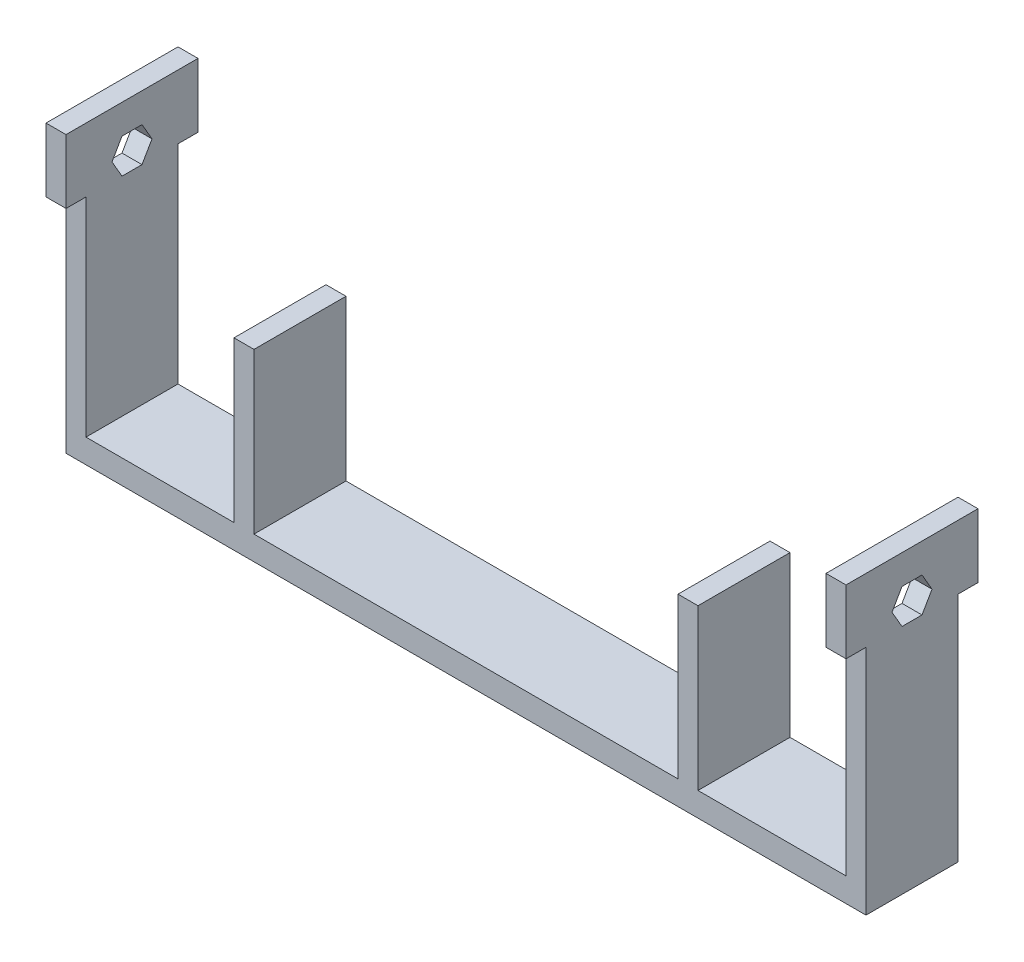
ISO-10303-21;
HEADER;
FILE_DESCRIPTION(('STEP AP214'),'2;1');
FILE_NAME('part.step','',(''),(''),'','','');
FILE_SCHEMA(('AUTOMOTIVE_DESIGN { 1 0 10303 214 1 1 1 1 }'));
ENDSEC;
DATA;
#1=APPLICATION_CONTEXT('core data for automotive mechanical design processes');
#2=APPLICATION_PROTOCOL_DEFINITION('international standard','automotive_design',2000,#1);
#3=PRODUCT_CONTEXT('',#1,'mechanical');
#4=PRODUCT('Part','Part','',(#3));
#5=PRODUCT_RELATED_PRODUCT_CATEGORY('part','',(#4));
#6=PRODUCT_DEFINITION_FORMATION('','',#4);
#7=PRODUCT_DEFINITION_CONTEXT('part definition',#1,'design');
#8=PRODUCT_DEFINITION('design','',#6,#7);
#9=PRODUCT_DEFINITION_SHAPE('','',#8);
#10=(LENGTH_UNIT() NAMED_UNIT(*) SI_UNIT(.MILLI.,.METRE.));
#11=(NAMED_UNIT(*) PLANE_ANGLE_UNIT() SI_UNIT($,.RADIAN.));
#12=(NAMED_UNIT(*) SI_UNIT($,.STERADIAN.) SOLID_ANGLE_UNIT());
#13=UNCERTAINTY_MEASURE_WITH_UNIT(LENGTH_MEASURE(1.E-05),#10,'distance_accuracy_value','');
#14=(GEOMETRIC_REPRESENTATION_CONTEXT(3) GLOBAL_UNCERTAINTY_ASSIGNED_CONTEXT((#13)) GLOBAL_UNIT_ASSIGNED_CONTEXT((#10,
#11,#12)) REPRESENTATION_CONTEXT('',''));
#15=CARTESIAN_POINT('',(0.,0.,0.));
#16=DIRECTION('',(0.,0.,1.));
#17=DIRECTION('',(1.,0.,0.));
#18=AXIS2_PLACEMENT_3D('',#15,#16,#17);
#19=CARTESIAN_POINT('',(0.,3.,0.));
#20=DIRECTION('',(0.,-1.,0.));
#21=DIRECTION('',(0.,0.,-1.));
#22=AXIS2_PLACEMENT_3D('',#19,#20,#21);
#23=PLANE('',#22);
#24=DIRECTION('',(0.,0.,-1.));
#25=VECTOR('',#24,1.);
#26=CARTESIAN_POINT('',(23.5,3.,-11.5));
#27=LINE('',#26,#25);
#28=CARTESIAN_POINT('',(23.5,3.,0.));
#29=VERTEX_POINT('',#28);
#30=CARTESIAN_POINT('',(23.5,3.,-11.5));
#31=VERTEX_POINT('',#30);
#32=EDGE_CURVE('E494',#29,#31,#27,.T.);
#33=ORIENTED_EDGE('',*,*,#32,.F.);
#34=DIRECTION('',(1.,0.,0.));
#35=VECTOR('',#34,1.);
#36=CARTESIAN_POINT('',(0.,3.,0.));
#37=LINE('',#36,#35);
#38=CARTESIAN_POINT('',(76.5,3.,0.));
#39=VERTEX_POINT('',#38);
#40=EDGE_CURVE('E592',#29,#39,#37,.T.);
#41=ORIENTED_EDGE('',*,*,#40,.T.);
#42=DIRECTION('',(0.,0.,1.));
#43=VECTOR('',#42,1.);
#44=CARTESIAN_POINT('',(76.5,3.,-11.5));
#45=LINE('',#44,#43);
#46=CARTESIAN_POINT('',(76.5,3.,-11.5));
#47=VERTEX_POINT('',#46);
#48=EDGE_CURVE('E499',#47,#39,#45,.T.);
#49=ORIENTED_EDGE('',*,*,#48,.F.);
#50=DIRECTION('',(-1.,0.,0.));
#51=VECTOR('',#50,1.);
#52=CARTESIAN_POINT('',(0.,3.,-11.5));
#53=LINE('',#52,#51);
#54=EDGE_CURVE('E598',#47,#31,#53,.T.);
#55=ORIENTED_EDGE('',*,*,#54,.T.);
#56=EDGE_LOOP('',(#33,#41,#49,#55));
#57=FACE_BOUND('',#56,.T.);
#58=ADVANCED_FACE('F43',(#57),#23,.F.);
#59=DIRECTION('',(0.,0.,1.));
#60=VECTOR('',#59,1.);
#61=CARTESIAN_POINT('',(21.,3.,-11.5));
#62=LINE('',#61,#60);
#63=CARTESIAN_POINT('',(21.,3.,-11.5));
#64=VERTEX_POINT('',#63);
#65=CARTESIAN_POINT('',(21.,3.,0.));
#66=VERTEX_POINT('',#65);
#67=EDGE_CURVE('E490',#64,#66,#62,.T.);
#68=ORIENTED_EDGE('',*,*,#67,.F.);
#69=CARTESIAN_POINT('',(2.5,3.,-11.5));
#70=VERTEX_POINT('',#69);
#71=EDGE_CURVE('E591',#64,#70,#53,.T.);
#72=ORIENTED_EDGE('',*,*,#71,.T.);
#73=DIRECTION('',(0.,0.,-1.));
#74=VECTOR('',#73,1.);
#75=CARTESIAN_POINT('',(2.5,3.,-11.5));
#76=LINE('',#75,#74);
#77=CARTESIAN_POINT('',(2.5,3.,0.));
#78=VERTEX_POINT('',#77);
#79=EDGE_CURVE('E560',#78,#70,#76,.T.);
#80=ORIENTED_EDGE('',*,*,#79,.F.);
#81=EDGE_CURVE('E588',#78,#66,#37,.T.);
#82=ORIENTED_EDGE('',*,*,#81,.T.);
#83=EDGE_LOOP('',(#68,#72,#80,#82));
#84=FACE_BOUND('',#83,.T.);
#85=ADVANCED_FACE('F689',(#84),#23,.F.);
#86=DIRECTION('',(0.,0.,-1.));
#87=VECTOR('',#86,1.);
#88=CARTESIAN_POINT('',(79.,3.,-11.5));
#89=LINE('',#88,#87);
#90=CARTESIAN_POINT('',(79.,3.,0.));
#91=VERTEX_POINT('',#90);
#92=CARTESIAN_POINT('',(79.,3.,-11.5));
#93=VERTEX_POINT('',#92);
#94=EDGE_CURVE('E516',#91,#93,#89,.T.);
#95=ORIENTED_EDGE('',*,*,#94,.F.);
#96=CARTESIAN_POINT('',(97.5,3.,0.));
#97=VERTEX_POINT('',#96);
#98=EDGE_CURVE('E593',#91,#97,#37,.T.);
#99=ORIENTED_EDGE('',*,*,#98,.T.);
#100=DIRECTION('',(0.,0.,1.));
#101=VECTOR('',#100,1.);
#102=CARTESIAN_POINT('',(97.5,3.,-11.5));
#103=LINE('',#102,#101);
#104=CARTESIAN_POINT('',(97.5,3.,-11.5));
#105=VERTEX_POINT('',#104);
#106=EDGE_CURVE('E556',#105,#97,#103,.T.);
#107=ORIENTED_EDGE('',*,*,#106,.F.);
#108=EDGE_CURVE('E594',#105,#93,#53,.T.);
#109=ORIENTED_EDGE('',*,*,#108,.T.);
#110=EDGE_LOOP('',(#95,#99,#107,#109));
#111=FACE_BOUND('',#110,.T.);
#112=ADVANCED_FACE('F692',(#111),#23,.F.);
#113=CARTESIAN_POINT('',(0.,3.,0.));
#114=DIRECTION('',(1.,0.,0.));
#115=DIRECTION('',(0.,0.,-1.));
#116=AXIS2_PLACEMENT_3D('',#113,#114,#115);
#117=PLANE('',#116);
#118=DIRECTION('',(0.,0.,-1.));
#119=VECTOR('',#118,1.);
#120=CARTESIAN_POINT('',(0.,29.,-4.5));
#121=LINE('',#120,#119);
#122=CARTESIAN_POINT('',(0.,29.,-4.5));
#123=VERTEX_POINT('',#122);
#124=CARTESIAN_POINT('',(0.,29.,-7.));
#125=VERTEX_POINT('',#124);
#126=EDGE_CURVE('E304',#123,#125,#121,.T.);
#127=ORIENTED_EDGE('',*,*,#126,.T.);
#128=DIRECTION('',(0.,0.866025403784439,-0.499999999999999));
#129=VECTOR('',#128,1.);
#130=CARTESIAN_POINT('',(0.,29.,-7.));
#131=LINE('',#130,#129);
#132=CARTESIAN_POINT('',(0.,31.1650635094611,-8.25));
#133=VERTEX_POINT('',#132);
#134=EDGE_CURVE('E284',#125,#133,#131,.T.);
#135=ORIENTED_EDGE('',*,*,#134,.T.);
#136=DIRECTION('',(0.,0.866025403784438,0.500000000000001));
#137=VECTOR('',#136,1.);
#138=CARTESIAN_POINT('',(0.,31.1650635094611,-8.25));
#139=LINE('',#138,#137);
#140=CARTESIAN_POINT('',(0.,33.3301270189222,-7.));
#141=VERTEX_POINT('',#140);
#142=EDGE_CURVE('E295',#133,#141,#139,.T.);
#143=ORIENTED_EDGE('',*,*,#142,.T.);
#144=DIRECTION('',(0.,0.,1.));
#145=VECTOR('',#144,1.);
#146=CARTESIAN_POINT('',(0.,33.3301270189222,-7.));
#147=LINE('',#146,#145);
#148=CARTESIAN_POINT('',(0.,33.3301270189222,-4.5));
#149=VERTEX_POINT('',#148);
#150=EDGE_CURVE('E59',#141,#149,#147,.T.);
#151=ORIENTED_EDGE('',*,*,#150,.T.);
#152=DIRECTION('',(0.,-0.866025403784439,0.499999999999999));
#153=VECTOR('',#152,1.);
#154=CARTESIAN_POINT('',(0.,33.3301270189222,-4.5));
#155=LINE('',#154,#153);
#156=CARTESIAN_POINT('',(0.,31.1650635094611,-3.25));
#157=VERTEX_POINT('',#156);
#158=EDGE_CURVE('E315',#149,#157,#155,.T.);
#159=ORIENTED_EDGE('',*,*,#158,.T.);
#160=DIRECTION('',(0.,-0.866025403784439,-0.5));
#161=VECTOR('',#160,1.);
#162=CARTESIAN_POINT('',(0.,31.1650635094611,-3.25));
#163=LINE('',#162,#161);
#164=EDGE_CURVE('E319',#157,#123,#163,.T.);
#165=ORIENTED_EDGE('',*,*,#164,.T.);
#166=EDGE_LOOP('',(#127,#135,#143,#151,#159,#165));
#167=FACE_BOUND('',#166,.T.);
#168=DIRECTION('',(0.,0.,1.));
#169=VECTOR('',#168,1.);
#170=CARTESIAN_POINT('',(0.,0.,0.));
#171=LINE('',#170,#169);
#172=CARTESIAN_POINT('',(0.,0.,-11.5));
#173=VERTEX_POINT('',#172);
#174=CARTESIAN_POINT('',(0.,0.,0.));
#175=VERTEX_POINT('',#174);
#176=EDGE_CURVE('E587',#173,#175,#171,.T.);
#177=ORIENTED_EDGE('',*,*,#176,.T.);
#178=DIRECTION('',(0.,-1.,0.));
#179=VECTOR('',#178,1.);
#180=CARTESIAN_POINT('',(0.,3.,0.));
#181=LINE('',#180,#179);
#182=CARTESIAN_POINT('',(0.,29.,0.));
#183=VERTEX_POINT('',#182);
#184=EDGE_CURVE('E622',#183,#175,#181,.T.);
#185=ORIENTED_EDGE('',*,*,#184,.F.);
#186=DIRECTION('',(0.,0.,1.));
#187=VECTOR('',#186,1.);
#188=CARTESIAN_POINT('',(0.,29.,-14.));
#189=LINE('',#188,#187);
#190=CARTESIAN_POINT('',(0.,29.,2.5));
#191=VERTEX_POINT('',#190);
#192=EDGE_CURVE('E417',#183,#191,#189,.T.);
#193=ORIENTED_EDGE('',*,*,#192,.T.);
#194=DIRECTION('',(0.,-1.,0.));
#195=VECTOR('',#194,1.);
#196=CARTESIAN_POINT('',(0.,37.,2.5));
#197=LINE('',#196,#195);
#198=CARTESIAN_POINT('',(0.,37.,2.5));
#199=VERTEX_POINT('',#198);
#200=EDGE_CURVE('E469',#199,#191,#197,.T.);
#201=ORIENTED_EDGE('',*,*,#200,.F.);
#202=DIRECTION('',(0.,0.,1.));
#203=VECTOR('',#202,1.);
#204=CARTESIAN_POINT('',(0.,37.,-14.));
#205=LINE('',#204,#203);
#206=CARTESIAN_POINT('',(0.,37.,-14.));
#207=VERTEX_POINT('',#206);
#208=EDGE_CURVE('E429',#207,#199,#205,.T.);
#209=ORIENTED_EDGE('',*,*,#208,.F.);
#210=DIRECTION('',(0.,-1.,0.));
#211=VECTOR('',#210,1.);
#212=CARTESIAN_POINT('',(0.,37.,-14.));
#213=LINE('',#212,#211);
#214=CARTESIAN_POINT('',(0.,29.,-14.));
#215=VERTEX_POINT('',#214);
#216=EDGE_CURVE('E443',#207,#215,#213,.T.);
#217=ORIENTED_EDGE('',*,*,#216,.T.);
#218=CARTESIAN_POINT('',(0.,29.,-11.5));
#219=VERTEX_POINT('',#218);
#220=EDGE_CURVE('E444',#215,#219,#189,.T.);
#221=ORIENTED_EDGE('',*,*,#220,.T.);
#222=DIRECTION('',(0.,-1.,0.));
#223=VECTOR('',#222,1.);
#224=CARTESIAN_POINT('',(0.,3.,-11.5));
#225=LINE('',#224,#223);
#226=EDGE_CURVE('E597',#219,#173,#225,.T.);
#227=ORIENTED_EDGE('',*,*,#226,.T.);
#228=EDGE_LOOP('',(#177,#185,#193,#201,#209,#217,#221,#227));
#229=FACE_BOUND('',#228,.T.);
#230=ADVANCED_FACE('F45',(#167,#229),#117,.F.);
#231=CARTESIAN_POINT('',(0.,3.,0.));
#232=DIRECTION('',(0.,0.,-1.));
#233=DIRECTION('',(-1.,0.,0.));
#234=AXIS2_PLACEMENT_3D('',#231,#232,#233);
#235=PLANE('',#234);
#236=DIRECTION('',(1.,0.,0.));
#237=VECTOR('',#236,1.);
#238=CARTESIAN_POINT('',(0.,0.,0.));
#239=LINE('',#238,#237);
#240=CARTESIAN_POINT('',(100.,0.,0.));
#241=VERTEX_POINT('',#240);
#242=EDGE_CURVE('E602',#175,#241,#239,.T.);
#243=ORIENTED_EDGE('',*,*,#242,.T.);
#244=DIRECTION('',(0.,-1.,0.));
#245=VECTOR('',#244,1.);
#246=CARTESIAN_POINT('',(100.,3.,0.));
#247=LINE('',#246,#245);
#248=CARTESIAN_POINT('',(100.,29.,0.));
#249=VERTEX_POINT('',#248);
#250=EDGE_CURVE('E618',#249,#241,#247,.T.);
#251=ORIENTED_EDGE('',*,*,#250,.F.);
#252=DIRECTION('',(1.,0.,0.));
#253=VECTOR('',#252,1.);
#254=CARTESIAN_POINT('',(100.,29.,0.));
#255=LINE('',#254,#253);
#256=CARTESIAN_POINT('',(97.5,29.,0.));
#257=VERTEX_POINT('',#256);
#258=EDGE_CURVE('E555',#257,#249,#255,.T.);
#259=ORIENTED_EDGE('',*,*,#258,.F.);
#260=DIRECTION('',(0.,-1.,0.));
#261=VECTOR('',#260,1.);
#262=CARTESIAN_POINT('',(97.5,29.,0.));
#263=LINE('',#262,#261);
#264=EDGE_CURVE('E551',#257,#97,#263,.T.);
#265=ORIENTED_EDGE('',*,*,#264,.T.);
#266=ORIENTED_EDGE('',*,*,#98,.F.);
#267=DIRECTION('',(0.,-1.,0.));
#268=VECTOR('',#267,1.);
#269=CARTESIAN_POINT('',(79.,23.,0.));
#270=LINE('',#269,#268);
#271=CARTESIAN_POINT('',(79.,23.,0.));
#272=VERTEX_POINT('',#271);
#273=EDGE_CURVE('E535',#272,#91,#270,.T.);
#274=ORIENTED_EDGE('',*,*,#273,.F.);
#275=DIRECTION('',(1.,0.,0.));
#276=VECTOR('',#275,1.);
#277=CARTESIAN_POINT('',(76.5,23.,0.));
#278=LINE('',#277,#276);
#279=CARTESIAN_POINT('',(76.5,23.,0.));
#280=VERTEX_POINT('',#279);
#281=EDGE_CURVE('E519',#280,#272,#278,.T.);
#282=ORIENTED_EDGE('',*,*,#281,.F.);
#283=DIRECTION('',(0.,-1.,0.));
#284=VECTOR('',#283,1.);
#285=CARTESIAN_POINT('',(76.5,23.,0.));
#286=LINE('',#285,#284);
#287=EDGE_CURVE('E539',#280,#39,#286,.T.);
#288=ORIENTED_EDGE('',*,*,#287,.T.);
#289=ORIENTED_EDGE('',*,*,#40,.F.);
#290=DIRECTION('',(0.,-1.,0.));
#291=VECTOR('',#290,1.);
#292=CARTESIAN_POINT('',(23.5,23.,0.));
#293=LINE('',#292,#291);
#294=CARTESIAN_POINT('',(23.5,23.,0.));
#295=VERTEX_POINT('',#294);
#296=EDGE_CURVE('E485',#295,#29,#293,.T.);
#297=ORIENTED_EDGE('',*,*,#296,.F.);
#298=DIRECTION('',(1.,0.,0.));
#299=VECTOR('',#298,1.);
#300=CARTESIAN_POINT('',(23.5,23.,0.));
#301=LINE('',#300,#299);
#302=CARTESIAN_POINT('',(21.,23.,0.));
#303=VERTEX_POINT('',#302);
#304=EDGE_CURVE('E489',#303,#295,#301,.T.);
#305=ORIENTED_EDGE('',*,*,#304,.F.);
#306=DIRECTION('',(0.,-1.,0.));
#307=VECTOR('',#306,1.);
#308=CARTESIAN_POINT('',(21.,23.,0.));
#309=LINE('',#308,#307);
#310=EDGE_CURVE('E481',#303,#66,#309,.T.);
#311=ORIENTED_EDGE('',*,*,#310,.T.);
#312=ORIENTED_EDGE('',*,*,#81,.F.);
#313=DIRECTION('',(0.,-1.,0.));
#314=VECTOR('',#313,1.);
#315=CARTESIAN_POINT('',(2.5,29.,0.));
#316=LINE('',#315,#314);
#317=CARTESIAN_POINT('',(2.5,29.,0.));
#318=VERTEX_POINT('',#317);
#319=EDGE_CURVE('E583',#318,#78,#316,.T.);
#320=ORIENTED_EDGE('',*,*,#319,.F.);
#321=DIRECTION('',(1.,0.,0.));
#322=VECTOR('',#321,1.);
#323=CARTESIAN_POINT('',(0.,29.,0.));
#324=LINE('',#323,#322);
#325=EDGE_CURVE('E568',#183,#318,#324,.T.);
#326=ORIENTED_EDGE('',*,*,#325,.F.);
#327=ORIENTED_EDGE('',*,*,#184,.T.);
#328=EDGE_LOOP('',(#243,#251,#259,#265,#266,#274,#282,#288,#289,#297,#305,#311,#312,#320,#326,#327));
#329=FACE_BOUND('',#328,.T.);
#330=ADVANCED_FACE('F704',(#329),#235,.F.);
#331=CARTESIAN_POINT('',(100.,3.,0.));
#332=DIRECTION('',(-1.,0.,0.));
#333=DIRECTION('',(0.,0.,1.));
#334=AXIS2_PLACEMENT_3D('',#331,#332,#333);
#335=PLANE('',#334);
#336=DIRECTION('',(0.,0.866025403784438,0.500000000000001));
#337=VECTOR('',#336,1.);
#338=CARTESIAN_POINT('',(100.,31.1650635094611,-8.25));
#339=LINE('',#338,#337);
#340=CARTESIAN_POINT('',(100.,31.1650635094611,-8.25));
#341=VERTEX_POINT('',#340);
#342=CARTESIAN_POINT('',(100.,33.3301270189222,-7.));
#343=VERTEX_POINT('',#342);
#344=EDGE_CURVE('E326',#341,#343,#339,.T.);
#345=ORIENTED_EDGE('',*,*,#344,.F.);
#346=DIRECTION('',(0.,0.866025403784439,-0.499999999999999));
#347=VECTOR('',#346,1.);
#348=CARTESIAN_POINT('',(100.,29.,-7.));
#349=LINE('',#348,#347);
#350=CARTESIAN_POINT('',(100.,29.,-7.));
#351=VERTEX_POINT('',#350);
#352=EDGE_CURVE('E67',#351,#341,#349,.T.);
#353=ORIENTED_EDGE('',*,*,#352,.F.);
#354=DIRECTION('',(0.,0.,-1.));
#355=VECTOR('',#354,1.);
#356=CARTESIAN_POINT('',(100.,29.,-4.5));
#357=LINE('',#356,#355);
#358=CARTESIAN_POINT('',(100.,29.,-4.5));
#359=VERTEX_POINT('',#358);
#360=EDGE_CURVE('E306',#359,#351,#357,.T.);
#361=ORIENTED_EDGE('',*,*,#360,.F.);
#362=DIRECTION('',(0.,-0.866025403784439,-0.5));
#363=VECTOR('',#362,1.);
#364=CARTESIAN_POINT('',(100.,31.1650635094611,-3.25));
#365=LINE('',#364,#363);
#366=CARTESIAN_POINT('',(100.,31.1650635094611,-3.25));
#367=VERTEX_POINT('',#366);
#368=EDGE_CURVE('E310',#367,#359,#365,.T.);
#369=ORIENTED_EDGE('',*,*,#368,.F.);
#370=DIRECTION('',(0.,-0.866025403784439,0.499999999999999));
#371=VECTOR('',#370,1.);
#372=CARTESIAN_POINT('',(100.,33.3301270189222,-4.5));
#373=LINE('',#372,#371);
#374=CARTESIAN_POINT('',(100.,33.3301270189222,-4.5));
#375=VERTEX_POINT('',#374);
#376=EDGE_CURVE('E334',#375,#367,#373,.T.);
#377=ORIENTED_EDGE('',*,*,#376,.F.);
#378=DIRECTION('',(0.,0.,1.));
#379=VECTOR('',#378,1.);
#380=CARTESIAN_POINT('',(100.,33.3301270189222,-7.));
#381=LINE('',#380,#379);
#382=EDGE_CURVE('E330',#343,#375,#381,.T.);
#383=ORIENTED_EDGE('',*,*,#382,.F.);
#384=EDGE_LOOP('',(#345,#353,#361,#369,#377,#383));
#385=FACE_BOUND('',#384,.T.);
#386=DIRECTION('',(0.,0.,-1.));
#387=VECTOR('',#386,1.);
#388=CARTESIAN_POINT('',(100.,0.,0.));
#389=LINE('',#388,#387);
#390=CARTESIAN_POINT('',(100.,0.,-11.5));
#391=VERTEX_POINT('',#390);
#392=EDGE_CURVE('E605',#241,#391,#389,.T.);
#393=ORIENTED_EDGE('',*,*,#392,.T.);
#394=DIRECTION('',(0.,-1.,0.));
#395=VECTOR('',#394,1.);
#396=CARTESIAN_POINT('',(100.,3.,-11.5));
#397=LINE('',#396,#395);
#398=CARTESIAN_POINT('',(100.,29.,-11.5));
#399=VERTEX_POINT('',#398);
#400=EDGE_CURVE('E614',#399,#391,#397,.T.);
#401=ORIENTED_EDGE('',*,*,#400,.F.);
#402=DIRECTION('',(0.,0.,-1.));
#403=VECTOR('',#402,1.);
#404=CARTESIAN_POINT('',(100.,29.,-14.));
#405=LINE('',#404,#403);
#406=CARTESIAN_POINT('',(100.,29.,-14.));
#407=VERTEX_POINT('',#406);
#408=EDGE_CURVE('E412',#399,#407,#405,.T.);
#409=ORIENTED_EDGE('',*,*,#408,.T.);
#410=DIRECTION('',(0.,-1.,0.));
#411=VECTOR('',#410,1.);
#412=CARTESIAN_POINT('',(100.,37.,-14.));
#413=LINE('',#412,#411);
#414=CARTESIAN_POINT('',(100.,37.,-14.));
#415=VERTEX_POINT('',#414);
#416=EDGE_CURVE('E383',#415,#407,#413,.T.);
#417=ORIENTED_EDGE('',*,*,#416,.F.);
#418=DIRECTION('',(0.,0.,-1.));
#419=VECTOR('',#418,1.);
#420=CARTESIAN_POINT('',(100.,37.,-14.));
#421=LINE('',#420,#419);
#422=CARTESIAN_POINT('',(100.,37.,2.5));
#423=VERTEX_POINT('',#422);
#424=EDGE_CURVE('E404',#423,#415,#421,.T.);
#425=ORIENTED_EDGE('',*,*,#424,.F.);
#426=DIRECTION('',(0.,-1.,0.));
#427=VECTOR('',#426,1.);
#428=CARTESIAN_POINT('',(100.,37.,2.5));
#429=LINE('',#428,#427);
#430=CARTESIAN_POINT('',(100.,29.,2.5));
#431=VERTEX_POINT('',#430);
#432=EDGE_CURVE('E395',#423,#431,#429,.T.);
#433=ORIENTED_EDGE('',*,*,#432,.T.);
#434=EDGE_CURVE('E413',#431,#249,#405,.T.);
#435=ORIENTED_EDGE('',*,*,#434,.T.);
#436=ORIENTED_EDGE('',*,*,#250,.T.);
#437=EDGE_LOOP('',(#393,#401,#409,#417,#425,#433,#435,#436));
#438=FACE_BOUND('',#437,.T.);
#439=ADVANCED_FACE('F666',(#385,#438),#335,.F.);
#440=CARTESIAN_POINT('',(0.,3.,-11.5));
#441=DIRECTION('',(0.,0.,1.));
#442=DIRECTION('',(1.,0.,0.));
#443=AXIS2_PLACEMENT_3D('',#440,#441,#442);
#444=PLANE('',#443);
#445=DIRECTION('',(-1.,0.,0.));
#446=VECTOR('',#445,1.);
#447=CARTESIAN_POINT('',(0.,0.,-11.5));
#448=LINE('',#447,#446);
#449=EDGE_CURVE('E608',#391,#173,#448,.T.);
#450=ORIENTED_EDGE('',*,*,#449,.T.);
#451=ORIENTED_EDGE('',*,*,#226,.F.);
#452=DIRECTION('',(-1.,0.,0.));
#453=VECTOR('',#452,1.);
#454=CARTESIAN_POINT('',(0.,29.,-11.5));
#455=LINE('',#454,#453);
#456=CARTESIAN_POINT('',(2.5,29.,-11.5));
#457=VERTEX_POINT('',#456);
#458=EDGE_CURVE('E572',#457,#219,#455,.T.);
#459=ORIENTED_EDGE('',*,*,#458,.F.);
#460=DIRECTION('',(0.,-1.,0.));
#461=VECTOR('',#460,1.);
#462=CARTESIAN_POINT('',(2.5,29.,-11.5));
#463=LINE('',#462,#461);
#464=EDGE_CURVE('E576',#457,#70,#463,.T.);
#465=ORIENTED_EDGE('',*,*,#464,.T.);
#466=ORIENTED_EDGE('',*,*,#71,.F.);
#467=DIRECTION('',(0.,-1.,0.));
#468=VECTOR('',#467,1.);
#469=CARTESIAN_POINT('',(21.,23.,-11.5));
#470=LINE('',#469,#468);
#471=CARTESIAN_POINT('',(21.,23.,-11.5));
#472=VERTEX_POINT('',#471);
#473=EDGE_CURVE('E477',#472,#64,#470,.T.);
#474=ORIENTED_EDGE('',*,*,#473,.F.);
#475=DIRECTION('',(-1.,0.,0.));
#476=VECTOR('',#475,1.);
#477=CARTESIAN_POINT('',(23.5,23.,-11.5));
#478=LINE('',#477,#476);
#479=CARTESIAN_POINT('',(23.5,23.,-11.5));
#480=VERTEX_POINT('',#479);
#481=EDGE_CURVE('E505',#480,#472,#478,.T.);
#482=ORIENTED_EDGE('',*,*,#481,.F.);
#483=DIRECTION('',(0.,-1.,0.));
#484=VECTOR('',#483,1.);
#485=CARTESIAN_POINT('',(23.5,23.,-11.5));
#486=LINE('',#485,#484);
#487=EDGE_CURVE('E473',#480,#31,#486,.T.);
#488=ORIENTED_EDGE('',*,*,#487,.T.);
#489=ORIENTED_EDGE('',*,*,#54,.F.);
#490=DIRECTION('',(0.,-1.,0.));
#491=VECTOR('',#490,1.);
#492=CARTESIAN_POINT('',(76.5,23.,-11.5));
#493=LINE('',#492,#491);
#494=CARTESIAN_POINT('',(76.5,23.,-11.5));
#495=VERTEX_POINT('',#494);
#496=EDGE_CURVE('E543',#495,#47,#493,.T.);
#497=ORIENTED_EDGE('',*,*,#496,.F.);
#498=DIRECTION('',(-1.,0.,0.));
#499=VECTOR('',#498,1.);
#500=CARTESIAN_POINT('',(76.5,23.,-11.5));
#501=LINE('',#500,#499);
#502=CARTESIAN_POINT('',(79.,23.,-11.5));
#503=VERTEX_POINT('',#502);
#504=EDGE_CURVE('E511',#503,#495,#501,.T.);
#505=ORIENTED_EDGE('',*,*,#504,.F.);
#506=DIRECTION('',(0.,-1.,0.));
#507=VECTOR('',#506,1.);
#508=CARTESIAN_POINT('',(79.,23.,-11.5));
#509=LINE('',#508,#507);
#510=EDGE_CURVE('E525',#503,#93,#509,.T.);
#511=ORIENTED_EDGE('',*,*,#510,.T.);
#512=ORIENTED_EDGE('',*,*,#108,.F.);
#513=DIRECTION('',(0.,-1.,0.));
#514=VECTOR('',#513,1.);
#515=CARTESIAN_POINT('',(97.5,29.,-11.5));
#516=LINE('',#515,#514);
#517=CARTESIAN_POINT('',(97.5,29.,-11.5));
#518=VERTEX_POINT('',#517);
#519=EDGE_CURVE('E547',#518,#105,#516,.T.);
#520=ORIENTED_EDGE('',*,*,#519,.F.);
#521=DIRECTION('',(-1.,0.,0.));
#522=VECTOR('',#521,1.);
#523=CARTESIAN_POINT('',(100.,29.,-11.5));
#524=LINE('',#523,#522);
#525=EDGE_CURVE('E561',#399,#518,#524,.T.);
#526=ORIENTED_EDGE('',*,*,#525,.F.);
#527=ORIENTED_EDGE('',*,*,#400,.T.);
#528=EDGE_LOOP('',(#450,#451,#459,#465,#466,#474,#482,#488,#489,#497,#505,#511,#512,#520,#526,#527));
#529=FACE_BOUND('',#528,.T.);
#530=ADVANCED_FACE('F803',(#529),#444,.F.);
#531=CARTESIAN_POINT('',(0.,0.,0.));
#532=DIRECTION('',(0.,-1.,0.));
#533=DIRECTION('',(0.,0.,-1.));
#534=AXIS2_PLACEMENT_3D('',#531,#532,#533);
#535=PLANE('',#534);
#536=ORIENTED_EDGE('',*,*,#176,.F.);
#537=ORIENTED_EDGE('',*,*,#449,.F.);
#538=ORIENTED_EDGE('',*,*,#392,.F.);
#539=ORIENTED_EDGE('',*,*,#242,.F.);
#540=EDGE_LOOP('',(#536,#537,#538,#539));
#541=FACE_BOUND('',#540,.T.);
#542=ADVANCED_FACE('F798',(#541),#535,.T.);
#543=CARTESIAN_POINT('',(2.5,29.,-11.5));
#544=DIRECTION('',(-1.,0.,0.));
#545=DIRECTION('',(0.,0.,1.));
#546=AXIS2_PLACEMENT_3D('',#543,#544,#545);
#547=PLANE('',#546);
#548=DIRECTION('',(0.,-0.866025403784438,-0.500000000000001));
#549=VECTOR('',#548,1.);
#550=CARTESIAN_POINT('',(2.5,28.1339745962156,-10.));
#551=LINE('',#550,#549);
#552=CARTESIAN_POINT('',(2.5,33.3301270189222,-7.));
#553=VERTEX_POINT('',#552);
#554=CARTESIAN_POINT('',(2.5,31.1650635094611,-8.25));
#555=VERTEX_POINT('',#554);
#556=EDGE_CURVE('E344',#553,#555,#551,.T.);
#557=ORIENTED_EDGE('',*,*,#556,.T.);
#558=DIRECTION('',(0.,-0.866025403784439,0.499999999999999));
#559=VECTOR('',#558,1.);
#560=CARTESIAN_POINT('',(2.5,30.948557158515,-8.125));
#561=LINE('',#560,#559);
#562=CARTESIAN_POINT('',(2.5,29.,-7.));
#563=VERTEX_POINT('',#562);
#564=EDGE_CURVE('E287',#555,#563,#561,.T.);
#565=ORIENTED_EDGE('',*,*,#564,.T.);
#566=DIRECTION('',(0.,0.,1.));
#567=VECTOR('',#566,1.);
#568=CARTESIAN_POINT('',(2.5,29.,-11.5));
#569=LINE('',#568,#567);
#570=CARTESIAN_POINT('',(2.5,29.,-4.5));
#571=VERTEX_POINT('',#570);
#572=EDGE_CURVE('E377',#563,#571,#569,.T.);
#573=ORIENTED_EDGE('',*,*,#572,.T.);
#574=DIRECTION('',(0.,0.866025403784439,0.5));
#575=VECTOR('',#574,1.);
#576=CARTESIAN_POINT('',(2.5,25.9689110867545,-6.25));
#577=LINE('',#576,#575);
#578=CARTESIAN_POINT('',(2.5,31.1650635094611,-3.25));
#579=VERTEX_POINT('',#578);
#580=EDGE_CURVE('E373',#571,#579,#577,.T.);
#581=ORIENTED_EDGE('',*,*,#580,.T.);
#582=DIRECTION('',(0.,0.866025403784439,-0.499999999999999));
#583=VECTOR('',#582,1.);
#584=CARTESIAN_POINT('',(2.5,33.1136206679761,-4.375));
#585=LINE('',#584,#583);
#586=CARTESIAN_POINT('',(2.5,33.3301270189222,-4.5));
#587=VERTEX_POINT('',#586);
#588=EDGE_CURVE('E369',#579,#587,#585,.T.);
#589=ORIENTED_EDGE('',*,*,#588,.T.);
#590=DIRECTION('',(0.,0.,-1.));
#591=VECTOR('',#590,1.);
#592=CARTESIAN_POINT('',(2.5,33.3301270189222,-11.5));
#593=LINE('',#592,#591);
#594=EDGE_CURVE('E365',#587,#553,#593,.T.);
#595=ORIENTED_EDGE('',*,*,#594,.T.);
#596=EDGE_LOOP('',(#557,#565,#573,#581,#589,#595));
#597=FACE_BOUND('',#596,.T.);
#598=ORIENTED_EDGE('',*,*,#79,.T.);
#599=ORIENTED_EDGE('',*,*,#464,.F.);
#600=DIRECTION('',(0.,0.,-1.));
#601=VECTOR('',#600,1.);
#602=CARTESIAN_POINT('',(2.5,29.,-14.));
#603=LINE('',#602,#601);
#604=CARTESIAN_POINT('',(2.5,29.,-14.));
#605=VERTEX_POINT('',#604);
#606=EDGE_CURVE('E451',#457,#605,#603,.T.);
#607=ORIENTED_EDGE('',*,*,#606,.T.);
#608=DIRECTION('',(0.,-1.,0.));
#609=VECTOR('',#608,1.);
#610=CARTESIAN_POINT('',(2.5,37.,-14.));
#611=LINE('',#610,#609);
#612=CARTESIAN_POINT('',(2.5,37.,-14.));
#613=VERTEX_POINT('',#612);
#614=EDGE_CURVE('E461',#613,#605,#611,.T.);
#615=ORIENTED_EDGE('',*,*,#614,.F.);
#616=DIRECTION('',(0.,0.,-1.));
#617=VECTOR('',#616,1.);
#618=CARTESIAN_POINT('',(2.5,37.,-14.));
#619=LINE('',#618,#617);
#620=CARTESIAN_POINT('',(2.5,37.,2.5));
#621=VERTEX_POINT('',#620);
#622=EDGE_CURVE('E437',#621,#613,#619,.T.);
#623=ORIENTED_EDGE('',*,*,#622,.F.);
#624=DIRECTION('',(0.,-1.,0.));
#625=VECTOR('',#624,1.);
#626=CARTESIAN_POINT('',(2.5,37.,2.5));
#627=LINE('',#626,#625);
#628=CARTESIAN_POINT('',(2.5,29.,2.5));
#629=VERTEX_POINT('',#628);
#630=EDGE_CURVE('E465',#621,#629,#627,.T.);
#631=ORIENTED_EDGE('',*,*,#630,.T.);
#632=EDGE_CURVE('E452',#629,#318,#603,.T.);
#633=ORIENTED_EDGE('',*,*,#632,.T.);
#634=ORIENTED_EDGE('',*,*,#319,.T.);
#635=EDGE_LOOP('',(#598,#599,#607,#615,#623,#631,#633,#634));
#636=FACE_BOUND('',#635,.T.);
#637=ADVANCED_FACE('F796',(#597,#636),#547,.F.);
#638=CARTESIAN_POINT('',(97.5,29.,-11.5));
#639=DIRECTION('',(1.,0.,0.));
#640=DIRECTION('',(0.,0.,-1.));
#641=AXIS2_PLACEMENT_3D('',#638,#639,#640);
#642=PLANE('',#641);
#643=DIRECTION('',(0.,0.,-1.));
#644=VECTOR('',#643,1.);
#645=CARTESIAN_POINT('',(97.5,29.,-11.5));
#646=LINE('',#645,#644);
#647=CARTESIAN_POINT('',(97.5,29.,-4.5));
#648=VERTEX_POINT('',#647);
#649=CARTESIAN_POINT('',(97.5,29.,-7.));
#650=VERTEX_POINT('',#649);
#651=EDGE_CURVE('E52',#648,#650,#646,.T.);
#652=ORIENTED_EDGE('',*,*,#651,.T.);
#653=DIRECTION('',(0.,0.866025403784439,-0.499999999999999));
#654=VECTOR('',#653,1.);
#655=CARTESIAN_POINT('',(97.5,30.948557158515,-8.125));
#656=LINE('',#655,#654);
#657=CARTESIAN_POINT('',(97.5,31.1650635094611,-8.25));
#658=VERTEX_POINT('',#657);
#659=EDGE_CURVE('E11',#650,#658,#656,.T.);
#660=ORIENTED_EDGE('',*,*,#659,.T.);
#661=DIRECTION('',(0.,0.866025403784438,0.500000000000001));
#662=VECTOR('',#661,1.);
#663=CARTESIAN_POINT('',(97.5,28.1339745962156,-10.));
#664=LINE('',#663,#662);
#665=CARTESIAN_POINT('',(97.5,33.3301270189222,-7.));
#666=VERTEX_POINT('',#665);
#667=EDGE_CURVE('E626',#658,#666,#664,.T.);
#668=ORIENTED_EDGE('',*,*,#667,.T.);
#669=DIRECTION('',(0.,0.,1.));
#670=VECTOR('',#669,1.);
#671=CARTESIAN_POINT('',(97.5,33.3301270189222,-11.5));
#672=LINE('',#671,#670);
#673=CARTESIAN_POINT('',(97.5,33.3301270189222,-4.5));
#674=VERTEX_POINT('',#673);
#675=EDGE_CURVE('E630',#666,#674,#672,.T.);
#676=ORIENTED_EDGE('',*,*,#675,.T.);
#677=DIRECTION('',(0.,-0.866025403784439,0.499999999999999));
#678=VECTOR('',#677,1.);
#679=CARTESIAN_POINT('',(97.5,33.1136206679761,-4.375));
#680=LINE('',#679,#678);
#681=CARTESIAN_POINT('',(97.5,31.1650635094611,-3.25));
#682=VERTEX_POINT('',#681);
#683=EDGE_CURVE('E634',#674,#682,#680,.T.);
#684=ORIENTED_EDGE('',*,*,#683,.T.);
#685=DIRECTION('',(0.,-0.866025403784439,-0.5));
#686=VECTOR('',#685,1.);
#687=CARTESIAN_POINT('',(97.5,25.9689110867545,-6.25));
#688=LINE('',#687,#686);
#689=EDGE_CURVE('E638',#682,#648,#688,.T.);
#690=ORIENTED_EDGE('',*,*,#689,.T.);
#691=EDGE_LOOP('',(#652,#660,#668,#676,#684,#690));
#692=FACE_BOUND('',#691,.T.);
#693=ORIENTED_EDGE('',*,*,#106,.T.);
#694=ORIENTED_EDGE('',*,*,#264,.F.);
#695=DIRECTION('',(0.,0.,1.));
#696=VECTOR('',#695,1.);
#697=CARTESIAN_POINT('',(97.5,29.,-14.));
#698=LINE('',#697,#696);
#699=CARTESIAN_POINT('',(97.5,29.,2.5));
#700=VERTEX_POINT('',#699);
#701=EDGE_CURVE('E403',#257,#700,#698,.T.);
#702=ORIENTED_EDGE('',*,*,#701,.T.);
#703=DIRECTION('',(0.,-1.,0.));
#704=VECTOR('',#703,1.);
#705=CARTESIAN_POINT('',(97.5,37.,2.5));
#706=LINE('',#705,#704);
#707=CARTESIAN_POINT('',(97.5,37.,2.5));
#708=VERTEX_POINT('',#707);
#709=EDGE_CURVE('E391',#708,#700,#706,.T.);
#710=ORIENTED_EDGE('',*,*,#709,.F.);
#711=DIRECTION('',(0.,0.,1.));
#712=VECTOR('',#711,1.);
#713=CARTESIAN_POINT('',(97.5,37.,-14.));
#714=LINE('',#713,#712);
#715=CARTESIAN_POINT('',(97.5,37.,-14.));
#716=VERTEX_POINT('',#715);
#717=EDGE_CURVE('E420',#716,#708,#714,.T.);
#718=ORIENTED_EDGE('',*,*,#717,.F.);
#719=DIRECTION('',(0.,-1.,0.));
#720=VECTOR('',#719,1.);
#721=CARTESIAN_POINT('',(97.5,37.,-14.));
#722=LINE('',#721,#720);
#723=CARTESIAN_POINT('',(97.5,29.,-14.));
#724=VERTEX_POINT('',#723);
#725=EDGE_CURVE('E387',#716,#724,#722,.T.);
#726=ORIENTED_EDGE('',*,*,#725,.T.);
#727=EDGE_CURVE('E405',#724,#518,#698,.T.);
#728=ORIENTED_EDGE('',*,*,#727,.T.);
#729=ORIENTED_EDGE('',*,*,#519,.T.);
#730=EDGE_LOOP('',(#693,#694,#702,#710,#718,#726,#728,#729));
#731=FACE_BOUND('',#730,.T.);
#732=ADVANCED_FACE('F644',(#692,#731),#642,.F.);
#733=CARTESIAN_POINT('',(76.5,23.,-11.5));
#734=DIRECTION('',(1.,0.,0.));
#735=DIRECTION('',(0.,0.,-1.));
#736=AXIS2_PLACEMENT_3D('',#733,#734,#735);
#737=PLANE('',#736);
#738=ORIENTED_EDGE('',*,*,#48,.T.);
#739=ORIENTED_EDGE('',*,*,#287,.F.);
#740=DIRECTION('',(0.,0.,1.));
#741=VECTOR('',#740,1.);
#742=CARTESIAN_POINT('',(76.5,23.,-11.5));
#743=LINE('',#742,#741);
#744=EDGE_CURVE('E515',#495,#280,#743,.T.);
#745=ORIENTED_EDGE('',*,*,#744,.F.);
#746=ORIENTED_EDGE('',*,*,#496,.T.);
#747=EDGE_LOOP('',(#738,#739,#745,#746));
#748=FACE_BOUND('',#747,.T.);
#749=ADVANCED_FACE('F724',(#748),#737,.F.);
#750=CARTESIAN_POINT('',(79.,23.,-11.5));
#751=DIRECTION('',(-1.,0.,0.));
#752=DIRECTION('',(0.,0.,1.));
#753=AXIS2_PLACEMENT_3D('',#750,#751,#752);
#754=PLANE('',#753);
#755=ORIENTED_EDGE('',*,*,#94,.T.);
#756=ORIENTED_EDGE('',*,*,#510,.F.);
#757=DIRECTION('',(0.,0.,-1.));
#758=VECTOR('',#757,1.);
#759=CARTESIAN_POINT('',(79.,23.,-11.5));
#760=LINE('',#759,#758);
#761=EDGE_CURVE('E522',#272,#503,#760,.T.);
#762=ORIENTED_EDGE('',*,*,#761,.F.);
#763=ORIENTED_EDGE('',*,*,#273,.T.);
#764=EDGE_LOOP('',(#755,#756,#762,#763));
#765=FACE_BOUND('',#764,.T.);
#766=ADVANCED_FACE('F715',(#765),#754,.F.);
#767=CARTESIAN_POINT('',(0.,23.,0.));
#768=DIRECTION('',(0.,-1.,0.));
#769=DIRECTION('',(0.,0.,-1.));
#770=AXIS2_PLACEMENT_3D('',#767,#768,#769);
#771=PLANE('',#770);
#772=ORIENTED_EDGE('',*,*,#504,.T.);
#773=ORIENTED_EDGE('',*,*,#744,.T.);
#774=ORIENTED_EDGE('',*,*,#281,.T.);
#775=ORIENTED_EDGE('',*,*,#761,.T.);
#776=EDGE_LOOP('',(#772,#773,#774,#775));
#777=FACE_BOUND('',#776,.T.);
#778=ADVANCED_FACE('F718',(#777),#771,.F.);
#779=CARTESIAN_POINT('',(23.5,23.,-11.5));
#780=DIRECTION('',(-1.,0.,0.));
#781=DIRECTION('',(0.,0.,1.));
#782=AXIS2_PLACEMENT_3D('',#779,#780,#781);
#783=PLANE('',#782);
#784=ORIENTED_EDGE('',*,*,#32,.T.);
#785=ORIENTED_EDGE('',*,*,#487,.F.);
#786=DIRECTION('',(0.,0.,-1.));
#787=VECTOR('',#786,1.);
#788=CARTESIAN_POINT('',(23.5,23.,-11.5));
#789=LINE('',#788,#787);
#790=EDGE_CURVE('E495',#295,#480,#789,.T.);
#791=ORIENTED_EDGE('',*,*,#790,.F.);
#792=ORIENTED_EDGE('',*,*,#296,.T.);
#793=EDGE_LOOP('',(#784,#785,#791,#792));
#794=FACE_BOUND('',#793,.T.);
#795=ADVANCED_FACE('F778',(#794),#783,.F.);
#796=CARTESIAN_POINT('',(21.,23.,-11.5));
#797=DIRECTION('',(1.,0.,0.));
#798=DIRECTION('',(0.,0.,-1.));
#799=AXIS2_PLACEMENT_3D('',#796,#797,#798);
#800=PLANE('',#799);
#801=ORIENTED_EDGE('',*,*,#67,.T.);
#802=ORIENTED_EDGE('',*,*,#310,.F.);
#803=DIRECTION('',(0.,0.,1.));
#804=VECTOR('',#803,1.);
#805=CARTESIAN_POINT('',(21.,23.,-11.5));
#806=LINE('',#805,#804);
#807=EDGE_CURVE('E502',#472,#303,#806,.T.);
#808=ORIENTED_EDGE('',*,*,#807,.F.);
#809=ORIENTED_EDGE('',*,*,#473,.T.);
#810=EDGE_LOOP('',(#801,#802,#808,#809));
#811=FACE_BOUND('',#810,.T.);
#812=ADVANCED_FACE('F781',(#811),#800,.F.);
#813=CARTESIAN_POINT('',(0.,23.,0.));
#814=DIRECTION('',(0.,-1.,0.));
#815=DIRECTION('',(0.,0.,-1.));
#816=AXIS2_PLACEMENT_3D('',#813,#814,#815);
#817=PLANE('',#816);
#818=ORIENTED_EDGE('',*,*,#790,.T.);
#819=ORIENTED_EDGE('',*,*,#481,.T.);
#820=ORIENTED_EDGE('',*,*,#807,.T.);
#821=ORIENTED_EDGE('',*,*,#304,.T.);
#822=EDGE_LOOP('',(#818,#819,#820,#821));
#823=FACE_BOUND('',#822,.T.);
#824=ADVANCED_FACE('F769',(#823),#817,.F.);
#825=CARTESIAN_POINT('',(0.,29.,0.));
#826=DIRECTION('',(0.,1.,0.));
#827=DIRECTION('',(0.,0.,1.));
#828=AXIS2_PLACEMENT_3D('',#825,#826,#827);
#829=PLANE('',#828);
#830=ORIENTED_EDGE('',*,*,#192,.F.);
#831=ORIENTED_EDGE('',*,*,#325,.T.);
#832=ORIENTED_EDGE('',*,*,#632,.F.);
#833=DIRECTION('',(1.,0.,0.));
#834=VECTOR('',#833,1.);
#835=CARTESIAN_POINT('',(0.,29.,2.5));
#836=LINE('',#835,#834);
#837=EDGE_CURVE('E448',#191,#629,#836,.T.);
#838=ORIENTED_EDGE('',*,*,#837,.F.);
#839=EDGE_LOOP('',(#830,#831,#832,#838));
#840=FACE_BOUND('',#839,.T.);
#841=ADVANCED_FACE('F765',(#840),#829,.F.);
#842=ORIENTED_EDGE('',*,*,#606,.F.);
#843=ORIENTED_EDGE('',*,*,#458,.T.);
#844=ORIENTED_EDGE('',*,*,#220,.F.);
#845=DIRECTION('',(-1.,0.,0.));
#846=VECTOR('',#845,1.);
#847=CARTESIAN_POINT('',(0.,29.,-14.));
#848=LINE('',#847,#846);
#849=EDGE_CURVE('E434',#605,#215,#848,.T.);
#850=ORIENTED_EDGE('',*,*,#849,.F.);
#851=EDGE_LOOP('',(#842,#843,#844,#850));
#852=FACE_BOUND('',#851,.T.);
#853=ADVANCED_FACE('F768',(#852),#829,.F.);
#854=CARTESIAN_POINT('',(0.,37.,2.5));
#855=DIRECTION('',(0.,0.,-1.));
#856=DIRECTION('',(-1.,0.,0.));
#857=AXIS2_PLACEMENT_3D('',#854,#855,#856);
#858=PLANE('',#857);
#859=ORIENTED_EDGE('',*,*,#837,.T.);
#860=ORIENTED_EDGE('',*,*,#630,.F.);
#861=DIRECTION('',(1.,0.,0.));
#862=VECTOR('',#861,1.);
#863=CARTESIAN_POINT('',(0.,37.,2.5));
#864=LINE('',#863,#862);
#865=EDGE_CURVE('E433',#199,#621,#864,.T.);
#866=ORIENTED_EDGE('',*,*,#865,.F.);
#867=ORIENTED_EDGE('',*,*,#200,.T.);
#868=EDGE_LOOP('',(#859,#860,#866,#867));
#869=FACE_BOUND('',#868,.T.);
#870=ADVANCED_FACE('F773',(#869),#858,.F.);
#871=CARTESIAN_POINT('',(0.,37.,-14.));
#872=DIRECTION('',(0.,0.,1.));
#873=DIRECTION('',(1.,0.,0.));
#874=AXIS2_PLACEMENT_3D('',#871,#872,#873);
#875=PLANE('',#874);
#876=ORIENTED_EDGE('',*,*,#849,.T.);
#877=ORIENTED_EDGE('',*,*,#216,.F.);
#878=DIRECTION('',(-1.,0.,0.));
#879=VECTOR('',#878,1.);
#880=CARTESIAN_POINT('',(0.,37.,-14.));
#881=LINE('',#880,#879);
#882=EDGE_CURVE('E440',#613,#207,#881,.T.);
#883=ORIENTED_EDGE('',*,*,#882,.F.);
#884=ORIENTED_EDGE('',*,*,#614,.T.);
#885=EDGE_LOOP('',(#876,#877,#883,#884));
#886=FACE_BOUND('',#885,.T.);
#887=ADVANCED_FACE('F763',(#886),#875,.F.);
#888=CARTESIAN_POINT('',(0.,37.,0.));
#889=DIRECTION('',(0.,1.,0.));
#890=DIRECTION('',(0.,0.,1.));
#891=AXIS2_PLACEMENT_3D('',#888,#889,#890);
#892=PLANE('',#891);
#893=ORIENTED_EDGE('',*,*,#208,.T.);
#894=ORIENTED_EDGE('',*,*,#865,.T.);
#895=ORIENTED_EDGE('',*,*,#622,.T.);
#896=ORIENTED_EDGE('',*,*,#882,.T.);
#897=EDGE_LOOP('',(#893,#894,#895,#896));
#898=FACE_BOUND('',#897,.T.);
#899=ADVANCED_FACE('F756',(#898),#892,.T.);
#900=CARTESIAN_POINT('',(0.,29.,0.));
#901=DIRECTION('',(0.,-1.,0.));
#902=DIRECTION('',(0.,0.,-1.));
#903=AXIS2_PLACEMENT_3D('',#900,#901,#902);
#904=PLANE('',#903);
#905=ORIENTED_EDGE('',*,*,#258,.T.);
#906=ORIENTED_EDGE('',*,*,#434,.F.);
#907=DIRECTION('',(1.,0.,0.));
#908=VECTOR('',#907,1.);
#909=CARTESIAN_POINT('',(100.,29.,2.5));
#910=LINE('',#909,#908);
#911=EDGE_CURVE('E400',#700,#431,#910,.T.);
#912=ORIENTED_EDGE('',*,*,#911,.F.);
#913=ORIENTED_EDGE('',*,*,#701,.F.);
#914=EDGE_LOOP('',(#905,#906,#912,#913));
#915=FACE_BOUND('',#914,.T.);
#916=ADVANCED_FACE('F753',(#915),#904,.T.);
#917=ORIENTED_EDGE('',*,*,#525,.T.);
#918=ORIENTED_EDGE('',*,*,#727,.F.);
#919=DIRECTION('',(-1.,0.,0.));
#920=VECTOR('',#919,1.);
#921=CARTESIAN_POINT('',(100.,29.,-14.));
#922=LINE('',#921,#920);
#923=EDGE_CURVE('E409',#407,#724,#922,.T.);
#924=ORIENTED_EDGE('',*,*,#923,.F.);
#925=ORIENTED_EDGE('',*,*,#408,.F.);
#926=EDGE_LOOP('',(#917,#918,#924,#925));
#927=FACE_BOUND('',#926,.T.);
#928=ADVANCED_FACE('F747',(#927),#904,.T.);
#929=CARTESIAN_POINT('',(100.,37.,-14.));
#930=DIRECTION('',(0.,0.,1.));
#931=DIRECTION('',(1.,0.,0.));
#932=AXIS2_PLACEMENT_3D('',#929,#930,#931);
#933=PLANE('',#932);
#934=ORIENTED_EDGE('',*,*,#923,.T.);
#935=ORIENTED_EDGE('',*,*,#725,.F.);
#936=DIRECTION('',(-1.,0.,0.));
#937=VECTOR('',#936,1.);
#938=CARTESIAN_POINT('',(100.,37.,-14.));
#939=LINE('',#938,#937);
#940=EDGE_CURVE('E423',#415,#716,#939,.T.);
#941=ORIENTED_EDGE('',*,*,#940,.F.);
#942=ORIENTED_EDGE('',*,*,#416,.T.);
#943=EDGE_LOOP('',(#934,#935,#941,#942));
#944=FACE_BOUND('',#943,.T.);
#945=ADVANCED_FACE('F743',(#944),#933,.F.);
#946=CARTESIAN_POINT('',(100.,37.,2.5));
#947=DIRECTION('',(0.,0.,-1.));
#948=DIRECTION('',(-1.,0.,0.));
#949=AXIS2_PLACEMENT_3D('',#946,#947,#948);
#950=PLANE('',#949);
#951=ORIENTED_EDGE('',*,*,#911,.T.);
#952=ORIENTED_EDGE('',*,*,#432,.F.);
#953=DIRECTION('',(1.,0.,0.));
#954=VECTOR('',#953,1.);
#955=CARTESIAN_POINT('',(100.,37.,2.5));
#956=LINE('',#955,#954);
#957=EDGE_CURVE('E399',#708,#423,#956,.T.);
#958=ORIENTED_EDGE('',*,*,#957,.F.);
#959=ORIENTED_EDGE('',*,*,#709,.T.);
#960=EDGE_LOOP('',(#951,#952,#958,#959));
#961=FACE_BOUND('',#960,.T.);
#962=ADVANCED_FACE('F746',(#961),#950,.F.);
#963=CARTESIAN_POINT('',(0.,37.,0.));
#964=DIRECTION('',(0.,-1.,0.));
#965=DIRECTION('',(0.,0.,-1.));
#966=AXIS2_PLACEMENT_3D('',#963,#964,#965);
#967=PLANE('',#966);
#968=ORIENTED_EDGE('',*,*,#424,.T.);
#969=ORIENTED_EDGE('',*,*,#940,.T.);
#970=ORIENTED_EDGE('',*,*,#717,.T.);
#971=ORIENTED_EDGE('',*,*,#957,.T.);
#972=EDGE_LOOP('',(#968,#969,#970,#971));
#973=FACE_BOUND('',#972,.T.);
#974=ADVANCED_FACE('F751',(#973),#967,.F.);
#975=CARTESIAN_POINT('',(0.,31.1650635094611,-8.25));
#976=DIRECTION('',(0.,0.500000000000001,-0.866025403784438));
#977=DIRECTION('',(0.,0.866025403784438,0.500000000000001));
#978=AXIS2_PLACEMENT_3D('',#975,#976,#977);
#979=PLANE('',#978);
#980=DIRECTION('',(1.,0.,0.));
#981=VECTOR('',#980,1.);
#982=CARTESIAN_POINT('',(0.,31.1650635094611,-8.25));
#983=LINE('',#982,#981);
#984=EDGE_CURVE('E292',#658,#341,#983,.T.);
#985=ORIENTED_EDGE('',*,*,#984,.T.);
#986=ORIENTED_EDGE('',*,*,#344,.T.);
#987=DIRECTION('',(1.,0.,0.));
#988=VECTOR('',#987,1.);
#989=CARTESIAN_POINT('',(0.,33.3301270189222,-7.));
#990=LINE('',#989,#988);
#991=EDGE_CURVE('E291',#666,#343,#990,.T.);
#992=ORIENTED_EDGE('',*,*,#991,.F.);
#993=ORIENTED_EDGE('',*,*,#667,.F.);
#994=EDGE_LOOP('',(#985,#986,#992,#993));
#995=FACE_BOUND('',#994,.T.);
#996=ADVANCED_FACE('F663',(#995),#979,.F.);
#997=CARTESIAN_POINT('',(0.,33.3301270189222,-7.));
#998=DIRECTION('',(0.,1.,0.));
#999=DIRECTION('',(0.,0.,1.));
#1000=AXIS2_PLACEMENT_3D('',#997,#998,#999);
#1001=PLANE('',#1000);
#1002=ORIENTED_EDGE('',*,*,#991,.T.);
#1003=ORIENTED_EDGE('',*,*,#382,.T.);
#1004=DIRECTION('',(1.,0.,0.));
#1005=VECTOR('',#1004,1.);
#1006=CARTESIAN_POINT('',(0.,33.3301270189222,-4.5));
#1007=LINE('',#1006,#1005);
#1008=EDGE_CURVE('E360',#674,#375,#1007,.T.);
#1009=ORIENTED_EDGE('',*,*,#1008,.F.);
#1010=ORIENTED_EDGE('',*,*,#675,.F.);
#1011=EDGE_LOOP('',(#1002,#1003,#1009,#1010));
#1012=FACE_BOUND('',#1011,.T.);
#1013=ADVANCED_FACE('F671',(#1012),#1001,.F.);
#1014=CARTESIAN_POINT('',(0.,33.3301270189222,-4.5));
#1015=DIRECTION('',(0.,0.499999999999999,0.866025403784439));
#1016=DIRECTION('',(0.,-0.866025403784439,0.499999999999999));
#1017=AXIS2_PLACEMENT_3D('',#1014,#1015,#1016);
#1018=PLANE('',#1017);
#1019=ORIENTED_EDGE('',*,*,#1008,.T.);
#1020=ORIENTED_EDGE('',*,*,#376,.T.);
#1021=DIRECTION('',(1.,0.,0.));
#1022=VECTOR('',#1021,1.);
#1023=CARTESIAN_POINT('',(0.,31.1650635094611,-3.25));
#1024=LINE('',#1023,#1022);
#1025=EDGE_CURVE('E355',#682,#367,#1024,.T.);
#1026=ORIENTED_EDGE('',*,*,#1025,.F.);
#1027=ORIENTED_EDGE('',*,*,#683,.F.);
#1028=EDGE_LOOP('',(#1019,#1020,#1026,#1027));
#1029=FACE_BOUND('',#1028,.T.);
#1030=ADVANCED_FACE('F674',(#1029),#1018,.F.);
#1031=CARTESIAN_POINT('',(0.,31.1650635094611,-3.25));
#1032=DIRECTION('',(0.,-0.5,0.866025403784439));
#1033=DIRECTION('',(0.,-0.866025403784439,-0.5));
#1034=AXIS2_PLACEMENT_3D('',#1031,#1032,#1033);
#1035=PLANE('',#1034);
#1036=ORIENTED_EDGE('',*,*,#1025,.T.);
#1037=ORIENTED_EDGE('',*,*,#368,.T.);
#1038=DIRECTION('',(1.,0.,0.));
#1039=VECTOR('',#1038,1.);
#1040=CARTESIAN_POINT('',(0.,29.,-4.5));
#1041=LINE('',#1040,#1039);
#1042=EDGE_CURVE('E350',#648,#359,#1041,.T.);
#1043=ORIENTED_EDGE('',*,*,#1042,.F.);
#1044=ORIENTED_EDGE('',*,*,#689,.F.);
#1045=EDGE_LOOP('',(#1036,#1037,#1043,#1044));
#1046=FACE_BOUND('',#1045,.T.);
#1047=ADVANCED_FACE('F651',(#1046),#1035,.F.);
#1048=CARTESIAN_POINT('',(0.,29.,-4.5));
#1049=DIRECTION('',(0.,-1.,0.));
#1050=DIRECTION('',(0.,0.,-1.));
#1051=AXIS2_PLACEMENT_3D('',#1048,#1049,#1050);
#1052=PLANE('',#1051);
#1053=ORIENTED_EDGE('',*,*,#1042,.T.);
#1054=ORIENTED_EDGE('',*,*,#360,.T.);
#1055=DIRECTION('',(1.,0.,0.));
#1056=VECTOR('',#1055,1.);
#1057=CARTESIAN_POINT('',(0.,29.,-7.));
#1058=LINE('',#1057,#1056);
#1059=EDGE_CURVE('E345',#650,#351,#1058,.T.);
#1060=ORIENTED_EDGE('',*,*,#1059,.F.);
#1061=ORIENTED_EDGE('',*,*,#651,.F.);
#1062=EDGE_LOOP('',(#1053,#1054,#1060,#1061));
#1063=FACE_BOUND('',#1062,.T.);
#1064=ADVANCED_FACE('F649',(#1063),#1052,.F.);
#1065=CARTESIAN_POINT('',(0.,29.,-7.));
#1066=DIRECTION('',(0.,-0.499999999999999,-0.866025403784439));
#1067=DIRECTION('',(0.,0.866025403784439,-0.499999999999999));
#1068=AXIS2_PLACEMENT_3D('',#1065,#1066,#1067);
#1069=PLANE('',#1068);
#1070=ORIENTED_EDGE('',*,*,#1059,.T.);
#1071=ORIENTED_EDGE('',*,*,#352,.T.);
#1072=ORIENTED_EDGE('',*,*,#984,.F.);
#1073=ORIENTED_EDGE('',*,*,#659,.F.);
#1074=EDGE_LOOP('',(#1070,#1071,#1072,#1073));
#1075=FACE_BOUND('',#1074,.T.);
#1076=ADVANCED_FACE('F732',(#1075),#1069,.F.);
#1077=EDGE_CURVE('E279',#133,#555,#983,.T.);
#1078=ORIENTED_EDGE('',*,*,#1077,.F.);
#1079=ORIENTED_EDGE('',*,*,#134,.F.);
#1080=EDGE_CURVE('E341',#125,#563,#1058,.T.);
#1081=ORIENTED_EDGE('',*,*,#1080,.T.);
#1082=ORIENTED_EDGE('',*,*,#564,.F.);
#1083=EDGE_LOOP('',(#1078,#1079,#1081,#1082));
#1084=FACE_BOUND('',#1083,.T.);
#1085=ADVANCED_FACE('F281',(#1084),#1069,.F.);
#1086=ORIENTED_EDGE('',*,*,#1080,.F.);
#1087=ORIENTED_EDGE('',*,*,#126,.F.);
#1088=EDGE_CURVE('E346',#123,#571,#1041,.T.);
#1089=ORIENTED_EDGE('',*,*,#1088,.T.);
#1090=ORIENTED_EDGE('',*,*,#572,.F.);
#1091=EDGE_LOOP('',(#1086,#1087,#1089,#1090));
#1092=FACE_BOUND('',#1091,.T.);
#1093=ADVANCED_FACE('F739',(#1092),#1052,.F.);
#1094=ORIENTED_EDGE('',*,*,#1088,.F.);
#1095=ORIENTED_EDGE('',*,*,#164,.F.);
#1096=EDGE_CURVE('E351',#157,#579,#1024,.T.);
#1097=ORIENTED_EDGE('',*,*,#1096,.T.);
#1098=ORIENTED_EDGE('',*,*,#580,.F.);
#1099=EDGE_LOOP('',(#1094,#1095,#1097,#1098));
#1100=FACE_BOUND('',#1099,.T.);
#1101=ADVANCED_FACE('F683',(#1100),#1035,.F.);
#1102=ORIENTED_EDGE('',*,*,#1096,.F.);
#1103=ORIENTED_EDGE('',*,*,#158,.F.);
#1104=EDGE_CURVE('E356',#149,#587,#1007,.T.);
#1105=ORIENTED_EDGE('',*,*,#1104,.T.);
#1106=ORIENTED_EDGE('',*,*,#588,.F.);
#1107=EDGE_LOOP('',(#1102,#1103,#1105,#1106));
#1108=FACE_BOUND('',#1107,.T.);
#1109=ADVANCED_FACE('F677',(#1108),#1018,.F.);
#1110=ORIENTED_EDGE('',*,*,#1104,.F.);
#1111=ORIENTED_EDGE('',*,*,#150,.F.);
#1112=EDGE_CURVE('E297',#141,#553,#990,.T.);
#1113=ORIENTED_EDGE('',*,*,#1112,.T.);
#1114=ORIENTED_EDGE('',*,*,#594,.F.);
#1115=EDGE_LOOP('',(#1110,#1111,#1113,#1114));
#1116=FACE_BOUND('',#1115,.T.);
#1117=ADVANCED_FACE('F685',(#1116),#1001,.F.);
#1118=ORIENTED_EDGE('',*,*,#1112,.F.);
#1119=ORIENTED_EDGE('',*,*,#142,.F.);
#1120=ORIENTED_EDGE('',*,*,#1077,.T.);
#1121=ORIENTED_EDGE('',*,*,#556,.F.);
#1122=EDGE_LOOP('',(#1118,#1119,#1120,#1121));
#1123=FACE_BOUND('',#1122,.T.);
#1124=ADVANCED_FACE('F296',(#1123),#979,.F.);
#1125=CLOSED_SHELL('',(#58,#85,#112,#230,#330,#439,#530,#542,#637,#732,#749,#766,#778,#795,#812,
#824,#841,#853,#870,#887,#899,#916,#928,#945,#962,#974,#996,#1013,#1030,#1047,#1064,#1076,#1085,
#1093,#1101,#1109,#1117,#1124));
#1126=MANIFOLD_SOLID_BREP('B2',#1125);
#1127=ADVANCED_BREP_SHAPE_REPRESENTATION('',(#18,#1126),#14);
#1128=SHAPE_DEFINITION_REPRESENTATION(#9,#1127);
ENDSEC;
END-ISO-10303-21;
